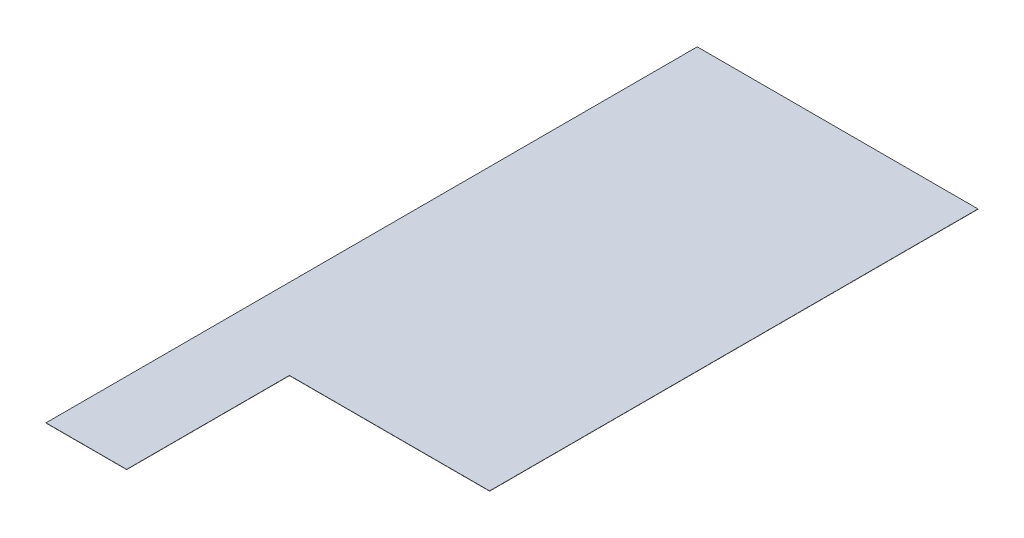
ISO-10303-21;
HEADER;
FILE_DESCRIPTION(('STEP AP214'),'2;1');
FILE_NAME('part.step','',(''),(''),'','','');
FILE_SCHEMA(('AUTOMOTIVE_DESIGN { 1 0 10303 214 1 1 1 1 }'));
ENDSEC;
DATA;
#1=APPLICATION_CONTEXT('core data for automotive mechanical design processes');
#2=APPLICATION_PROTOCOL_DEFINITION('international standard','automotive_design',2000,#1);
#3=PRODUCT_CONTEXT('',#1,'mechanical');
#4=PRODUCT('Part','Part','',(#3));
#5=PRODUCT_RELATED_PRODUCT_CATEGORY('part','',(#4));
#6=PRODUCT_DEFINITION_FORMATION('','',#4);
#7=PRODUCT_DEFINITION_CONTEXT('part definition',#1,'design');
#8=PRODUCT_DEFINITION('design','',#6,#7);
#9=PRODUCT_DEFINITION_SHAPE('','',#8);
#10=(LENGTH_UNIT() NAMED_UNIT(*) SI_UNIT(.MILLI.,.METRE.));
#11=(NAMED_UNIT(*) PLANE_ANGLE_UNIT() SI_UNIT($,.RADIAN.));
#12=(NAMED_UNIT(*) SI_UNIT($,.STERADIAN.) SOLID_ANGLE_UNIT());
#13=UNCERTAINTY_MEASURE_WITH_UNIT(LENGTH_MEASURE(1.E-05),#10,'distance_accuracy_value','');
#14=(GEOMETRIC_REPRESENTATION_CONTEXT(3) GLOBAL_UNCERTAINTY_ASSIGNED_CONTEXT((#13)) GLOBAL_UNIT_ASSIGNED_CONTEXT((#10,
#11,#12)) REPRESENTATION_CONTEXT('',''));
#15=CARTESIAN_POINT('',(0.,0.,0.));
#16=DIRECTION('',(0.,0.,1.));
#17=DIRECTION('',(1.,0.,0.));
#18=AXIS2_PLACEMENT_3D('',#15,#16,#17);
#19=CARTESIAN_POINT('',(1051.306,1.5875,2438.4));
#20=DIRECTION('',(-1.,0.,0.));
#21=DIRECTION('',(0.,0.,1.));
#22=AXIS2_PLACEMENT_3D('',#19,#20,#21);
#23=PLANE('',#22);
#24=DIRECTION('',(0.,0.,-1.));
#25=VECTOR('',#24,1.);
#26=CARTESIAN_POINT('',(1051.306,1.5875,2438.4));
#27=LINE('',#26,#25);
#28=CARTESIAN_POINT('',(1051.306,1.5875,1219.2));
#29=VERTEX_POINT('',#28);
#30=CARTESIAN_POINT('',(1051.306,1.5875,-2438.4));
#31=VERTEX_POINT('',#30);
#32=EDGE_CURVE('E84',#29,#31,#27,.T.);
#33=ORIENTED_EDGE('',*,*,#32,.F.);
#34=DIRECTION('',(0.,1.,0.));
#35=VECTOR('',#34,1.);
#36=CARTESIAN_POINT('',(1051.306,0.,1219.2));
#37=LINE('',#36,#35);
#38=CARTESIAN_POINT('',(1051.306,0.,1219.2));
#39=VERTEX_POINT('',#38);
#40=EDGE_CURVE('E104',#39,#29,#37,.T.);
#41=ORIENTED_EDGE('',*,*,#40,.F.);
#42=DIRECTION('',(0.,0.,-1.));
#43=VECTOR('',#42,1.);
#44=CARTESIAN_POINT('',(1051.306,0.,2438.4));
#45=LINE('',#44,#43);
#46=CARTESIAN_POINT('',(1051.306,0.,-2438.4));
#47=VERTEX_POINT('',#46);
#48=EDGE_CURVE('E111',#39,#47,#45,.T.);
#49=ORIENTED_EDGE('',*,*,#48,.T.);
#50=DIRECTION('',(0.,-1.,0.));
#51=VECTOR('',#50,1.);
#52=CARTESIAN_POINT('',(1051.306,1.5875,-2438.4));
#53=LINE('',#52,#51);
#54=EDGE_CURVE('E11',#31,#47,#53,.T.);
#55=ORIENTED_EDGE('',*,*,#54,.F.);
#56=EDGE_LOOP('',(#33,#41,#49,#55));
#57=FACE_BOUND('',#56,.T.);
#58=ADVANCED_FACE('F39',(#57),#23,.F.);
#59=CARTESIAN_POINT('',(-1051.306,1.5875,-2438.4));
#60=DIRECTION('',(0.,0.,1.));
#61=DIRECTION('',(1.,0.,0.));
#62=AXIS2_PLACEMENT_3D('',#59,#60,#61);
#63=PLANE('',#62);
#64=DIRECTION('',(-1.,0.,0.));
#65=VECTOR('',#64,1.);
#66=CARTESIAN_POINT('',(-1051.306,0.,-2438.4));
#67=LINE('',#66,#65);
#68=CARTESIAN_POINT('',(-1051.306,0.,-2438.4));
#69=VERTEX_POINT('',#68);
#70=EDGE_CURVE('E115',#47,#69,#67,.T.);
#71=ORIENTED_EDGE('',*,*,#70,.T.);
#72=DIRECTION('',(0.,-1.,0.));
#73=VECTOR('',#72,1.);
#74=CARTESIAN_POINT('',(-1051.306,1.5875,-2438.4));
#75=LINE('',#74,#73);
#76=CARTESIAN_POINT('',(-1051.306,1.5875,-2438.4));
#77=VERTEX_POINT('',#76);
#78=EDGE_CURVE('E46',#77,#69,#75,.T.);
#79=ORIENTED_EDGE('',*,*,#78,.F.);
#80=DIRECTION('',(-1.,0.,0.));
#81=VECTOR('',#80,1.);
#82=CARTESIAN_POINT('',(-1051.306,1.5875,-2438.4));
#83=LINE('',#82,#81);
#84=EDGE_CURVE('E140',#31,#77,#83,.T.);
#85=ORIENTED_EDGE('',*,*,#84,.F.);
#86=ORIENTED_EDGE('',*,*,#54,.T.);
#87=EDGE_LOOP('',(#71,#79,#85,#86));
#88=FACE_BOUND('',#87,.T.);
#89=ADVANCED_FACE('F159',(#88),#63,.F.);
#90=CARTESIAN_POINT('',(-1051.306,1.5875,2438.4));
#91=DIRECTION('',(1.,0.,0.));
#92=DIRECTION('',(0.,0.,-1.));
#93=AXIS2_PLACEMENT_3D('',#90,#91,#92);
#94=PLANE('',#93);
#95=DIRECTION('',(0.,0.,1.));
#96=VECTOR('',#95,1.);
#97=CARTESIAN_POINT('',(-1051.306,0.,2438.4));
#98=LINE('',#97,#96);
#99=CARTESIAN_POINT('',(-1051.306,0.,2438.4));
#100=VERTEX_POINT('',#99);
#101=EDGE_CURVE('E79',#69,#100,#98,.T.);
#102=ORIENTED_EDGE('',*,*,#101,.T.);
#103=DIRECTION('',(0.,-1.,0.));
#104=VECTOR('',#103,1.);
#105=CARTESIAN_POINT('',(-1051.306,1.5875,2438.4));
#106=LINE('',#105,#104);
#107=CARTESIAN_POINT('',(-1051.306,1.5875,2438.4));
#108=VERTEX_POINT('',#107);
#109=EDGE_CURVE('E130',#108,#100,#106,.T.);
#110=ORIENTED_EDGE('',*,*,#109,.F.);
#111=DIRECTION('',(0.,0.,1.));
#112=VECTOR('',#111,1.);
#113=CARTESIAN_POINT('',(-1051.306,1.5875,2438.4));
#114=LINE('',#113,#112);
#115=EDGE_CURVE('E62',#77,#108,#114,.T.);
#116=ORIENTED_EDGE('',*,*,#115,.F.);
#117=ORIENTED_EDGE('',*,*,#78,.T.);
#118=EDGE_LOOP('',(#102,#110,#116,#117));
#119=FACE_BOUND('',#118,.T.);
#120=ADVANCED_FACE('F132',(#119),#94,.F.);
#121=CARTESIAN_POINT('',(-1051.306,1.5875,2438.4));
#122=DIRECTION('',(0.,0.,-1.));
#123=DIRECTION('',(-1.,0.,0.));
#124=AXIS2_PLACEMENT_3D('',#121,#122,#123);
#125=PLANE('',#124);
#126=DIRECTION('',(1.,0.,0.));
#127=VECTOR('',#126,1.);
#128=CARTESIAN_POINT('',(-1051.306,0.,2438.4));
#129=LINE('',#128,#127);
#130=CARTESIAN_POINT('',(-447.293999999999,0.,2438.4));
#131=VERTEX_POINT('',#130);
#132=EDGE_CURVE('E127',#100,#131,#129,.T.);
#133=ORIENTED_EDGE('',*,*,#132,.T.);
#134=DIRECTION('',(0.,1.,0.));
#135=VECTOR('',#134,1.);
#136=CARTESIAN_POINT('',(-447.293999999999,0.,2438.4));
#137=LINE('',#136,#135);
#138=CARTESIAN_POINT('',(-447.293999999999,1.5875,2438.4));
#139=VERTEX_POINT('',#138);
#140=EDGE_CURVE('E139',#131,#139,#137,.T.);
#141=ORIENTED_EDGE('',*,*,#140,.T.);
#142=DIRECTION('',(1.,0.,0.));
#143=VECTOR('',#142,1.);
#144=CARTESIAN_POINT('',(-1051.306,1.5875,2438.4));
#145=LINE('',#144,#143);
#146=EDGE_CURVE('E123',#108,#139,#145,.T.);
#147=ORIENTED_EDGE('',*,*,#146,.F.);
#148=ORIENTED_EDGE('',*,*,#109,.T.);
#149=EDGE_LOOP('',(#133,#141,#147,#148));
#150=FACE_BOUND('',#149,.T.);
#151=ADVANCED_FACE('F137',(#150),#125,.F.);
#152=CARTESIAN_POINT('',(0.,1.5875,0.));
#153=DIRECTION('',(0.,-1.,0.));
#154=DIRECTION('',(0.,0.,-1.));
#155=AXIS2_PLACEMENT_3D('',#152,#153,#154);
#156=PLANE('',#155);
#157=ORIENTED_EDGE('',*,*,#146,.T.);
#158=DIRECTION('',(0.,0.,-1.));
#159=VECTOR('',#158,1.);
#160=CARTESIAN_POINT('',(-447.293999999999,1.5875,0.));
#161=LINE('',#160,#159);
#162=CARTESIAN_POINT('',(-447.293999999999,1.5875,1219.2));
#163=VERTEX_POINT('',#162);
#164=EDGE_CURVE('E116',#139,#163,#161,.T.);
#165=ORIENTED_EDGE('',*,*,#164,.T.);
#166=DIRECTION('',(1.,0.,0.));
#167=VECTOR('',#166,1.);
#168=CARTESIAN_POINT('',(3.61292916488187E-13,1.5875,1219.2));
#169=LINE('',#168,#167);
#170=EDGE_CURVE('E120',#163,#29,#169,.T.);
#171=ORIENTED_EDGE('',*,*,#170,.T.);
#172=ORIENTED_EDGE('',*,*,#32,.T.);
#173=ORIENTED_EDGE('',*,*,#84,.T.);
#174=ORIENTED_EDGE('',*,*,#115,.T.);
#175=EDGE_LOOP('',(#157,#165,#171,#172,#173,#174));
#176=FACE_BOUND('',#175,.T.);
#177=ADVANCED_FACE('F148',(#176),#156,.F.);
#178=CARTESIAN_POINT('',(0.,0.,0.));
#179=DIRECTION('',(0.,-1.,0.));
#180=DIRECTION('',(0.,0.,-1.));
#181=AXIS2_PLACEMENT_3D('',#178,#179,#180);
#182=PLANE('',#181);
#183=DIRECTION('',(0.,0.,1.));
#184=VECTOR('',#183,1.);
#185=CARTESIAN_POINT('',(-447.293999999999,0.,2438.4));
#186=LINE('',#185,#184);
#187=CARTESIAN_POINT('',(-447.293999999999,0.,1219.2));
#188=VERTEX_POINT('',#187);
#189=EDGE_CURVE('E53',#188,#131,#186,.T.);
#190=ORIENTED_EDGE('',*,*,#189,.T.);
#191=ORIENTED_EDGE('',*,*,#132,.F.);
#192=ORIENTED_EDGE('',*,*,#101,.F.);
#193=ORIENTED_EDGE('',*,*,#70,.F.);
#194=ORIENTED_EDGE('',*,*,#48,.F.);
#195=DIRECTION('',(-1.,0.,0.));
#196=VECTOR('',#195,1.);
#197=CARTESIAN_POINT('',(1051.306,0.,1219.2));
#198=LINE('',#197,#196);
#199=EDGE_CURVE('E101',#39,#188,#198,.T.);
#200=ORIENTED_EDGE('',*,*,#199,.T.);
#201=EDGE_LOOP('',(#190,#191,#192,#193,#194,#200));
#202=FACE_BOUND('',#201,.T.);
#203=ADVANCED_FACE('F114',(#202),#182,.T.);
#204=CARTESIAN_POINT('',(-447.293999999999,0.,2438.4));
#205=DIRECTION('',(-1.,0.,0.));
#206=DIRECTION('',(0.,0.,1.));
#207=AXIS2_PLACEMENT_3D('',#204,#205,#206);
#208=PLANE('',#207);
#209=ORIENTED_EDGE('',*,*,#140,.F.);
#210=ORIENTED_EDGE('',*,*,#189,.F.);
#211=DIRECTION('',(0.,1.,0.));
#212=VECTOR('',#211,1.);
#213=CARTESIAN_POINT('',(-447.293999999999,0.,1219.2));
#214=LINE('',#213,#212);
#215=EDGE_CURVE('E105',#188,#163,#214,.T.);
#216=ORIENTED_EDGE('',*,*,#215,.T.);
#217=ORIENTED_EDGE('',*,*,#164,.F.);
#218=EDGE_LOOP('',(#209,#210,#216,#217));
#219=FACE_BOUND('',#218,.T.);
#220=ADVANCED_FACE('F147',(#219),#208,.F.);
#221=CARTESIAN_POINT('',(1051.306,0.,1219.2));
#222=DIRECTION('',(0.,0.,-1.));
#223=DIRECTION('',(-1.,0.,0.));
#224=AXIS2_PLACEMENT_3D('',#221,#222,#223);
#225=PLANE('',#224);
#226=ORIENTED_EDGE('',*,*,#215,.F.);
#227=ORIENTED_EDGE('',*,*,#199,.F.);
#228=ORIENTED_EDGE('',*,*,#40,.T.);
#229=ORIENTED_EDGE('',*,*,#170,.F.);
#230=EDGE_LOOP('',(#226,#227,#228,#229));
#231=FACE_BOUND('',#230,.T.);
#232=ADVANCED_FACE('F103',(#231),#225,.F.);
#233=CLOSED_SHELL('',(#58,#89,#120,#151,#177,#203,#220,#232));
#234=MANIFOLD_SOLID_BREP('B2',#233);
#235=ADVANCED_BREP_SHAPE_REPRESENTATION('',(#18,#234),#14);
#236=SHAPE_DEFINITION_REPRESENTATION(#9,#235);
ENDSEC;
END-ISO-10303-21;
